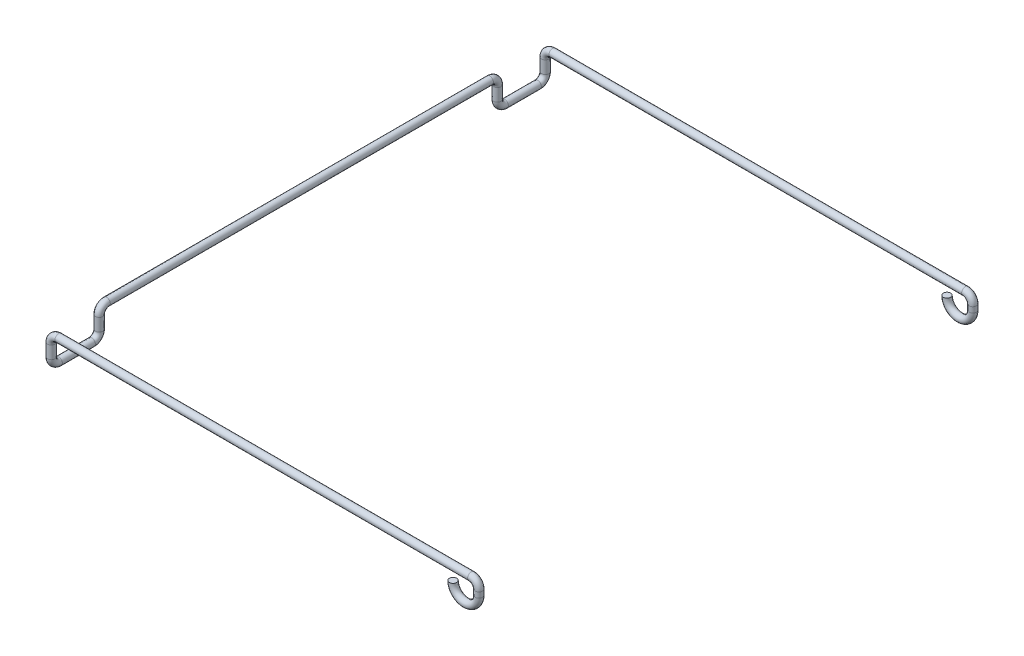
ISO-10303-21;
HEADER;
FILE_DESCRIPTION(('STEP AP214'),'2;1');
FILE_NAME('part.step','',(''),(''),'','','');
FILE_SCHEMA(('AUTOMOTIVE_DESIGN { 1 0 10303 214 1 1 1 1 }'));
ENDSEC;
DATA;
#1=APPLICATION_CONTEXT('core data for automotive mechanical design processes');
#2=APPLICATION_PROTOCOL_DEFINITION('international standard','automotive_design',2000,#1);
#3=PRODUCT_CONTEXT('',#1,'mechanical');
#4=PRODUCT('Part','Part','',(#3));
#5=PRODUCT_RELATED_PRODUCT_CATEGORY('part','',(#4));
#6=PRODUCT_DEFINITION_FORMATION('','',#4);
#7=PRODUCT_DEFINITION_CONTEXT('part definition',#1,'design');
#8=PRODUCT_DEFINITION('design','',#6,#7);
#9=PRODUCT_DEFINITION_SHAPE('','',#8);
#10=(LENGTH_UNIT() NAMED_UNIT(*) SI_UNIT(.MILLI.,.METRE.));
#11=(NAMED_UNIT(*) PLANE_ANGLE_UNIT() SI_UNIT($,.RADIAN.));
#12=(NAMED_UNIT(*) SI_UNIT($,.STERADIAN.) SOLID_ANGLE_UNIT());
#13=UNCERTAINTY_MEASURE_WITH_UNIT(LENGTH_MEASURE(1.E-05),#10,'distance_accuracy_value','');
#14=(GEOMETRIC_REPRESENTATION_CONTEXT(3) GLOBAL_UNCERTAINTY_ASSIGNED_CONTEXT((#13)) GLOBAL_UNIT_ASSIGNED_CONTEXT((#10,
#11,#12)) REPRESENTATION_CONTEXT('',''));
#15=CARTESIAN_POINT('',(0.,0.,0.));
#16=DIRECTION('',(0.,0.,1.));
#17=DIRECTION('',(1.,0.,0.));
#18=AXIS2_PLACEMENT_3D('',#15,#16,#17);
#19=CARTESIAN_POINT('',(45.9214738534762,-1.75000000000003,33.5));
#20=DIRECTION('',(0.,1.,0.));
#21=DIRECTION('',(1.,0.,0.));
#22=AXIS2_PLACEMENT_3D('',#19,#20,#21);
#23=PLANE('',#22);
#24=CARTESIAN_POINT('',(45.9214738534762,-1.75000000000003,33.5));
#25=DIRECTION('',(0.,1.,0.));
#26=DIRECTION('',(1.,0.,0.));
#27=AXIS2_PLACEMENT_3D('',#24,#25,#26);
#28=CIRCLE('',#27,0.500000000000001);
#29=CARTESIAN_POINT('',(45.4214738534762,-1.75000000000003,33.5));
#30=VERTEX_POINT('',#29);
#31=EDGE_CURVE('E110',#30,#30,#28,.T.);
#32=ORIENTED_EDGE('',*,*,#31,.T.);
#33=EDGE_LOOP('',(#32));
#34=FACE_BOUND('',#33,.T.);
#35=ADVANCED_FACE('F34',(#34),#23,.T.);
#36=CARTESIAN_POINT('',(45.9214763306861,-1.75294452515231,-33.5));
#37=DIRECTION('',(0.00168258580132002,-0.999998584451509,0.));
#38=DIRECTION('',(0.999998584451509,0.00168258580132002,0.));
#39=AXIS2_PLACEMENT_3D('',#36,#37,#38);
#40=PLANE('',#39);
#41=CARTESIAN_POINT('',(45.9214763306861,-1.75294452515231,-33.5));
#42=DIRECTION('',(0.00168258580132002,-0.999998584451509,0.));
#43=DIRECTION('',(0.999998584451509,0.00168258580132002,0.));
#44=AXIS2_PLACEMENT_3D('',#41,#42,#43);
#45=CIRCLE('',#44,0.500000000000001);
#46=CARTESIAN_POINT('',(45.4214770384604,-1.75378581805297,-33.5));
#47=VERTEX_POINT('',#46);
#48=EDGE_CURVE('E10',#47,#47,#45,.T.);
#49=ORIENTED_EDGE('',*,*,#48,.F.);
#50=EDGE_LOOP('',(#49));
#51=FACE_BOUND('',#50,.T.);
#52=ADVANCED_FACE('F118',(#51),#40,.F.);
#53=CARTESIAN_POINT('',(47.6714738534762,-1.75000000000003,33.5));
#54=DIRECTION('',(0.,0.,1.));
#55=DIRECTION('',(0.,-1.,0.));
#56=AXIS2_PLACEMENT_3D('',#53,#54,#55);
#57=TOROIDAL_SURFACE('',#56,1.75000000000004,0.500000000000001);
#58=CARTESIAN_POINT('',(49.4214738534763,-1.75000000000003,33.5));
#59=DIRECTION('',(0.,-1.,0.));
#60=DIRECTION('',(-1.,0.,0.));
#61=AXIS2_PLACEMENT_3D('',#58,#59,#60);
#62=CIRCLE('',#61,0.500000000000001);
#63=CARTESIAN_POINT('',(49.9214738534763,-1.75000000000003,33.5));
#64=VERTEX_POINT('',#63);
#65=EDGE_CURVE('E107',#64,#64,#62,.T.);
#66=CARTESIAN_POINT('',(47.6714738534762,-1.75000000000003,33.5));
#67=DIRECTION('',(0.,0.,1.));
#68=DIRECTION('',(0.,-1.,0.));
#69=AXIS2_PLACEMENT_3D('',#66,#67,#68);
#70=CIRCLE('',#69,2.25000000000004);
#71=EDGE_CURVE('',#30,#64,#70,.T.);
#72=ORIENTED_EDGE('',*,*,#31,.F.);
#73=ORIENTED_EDGE('',*,*,#65,.T.);
#74=ORIENTED_EDGE('',*,*,#71,.T.);
#75=ORIENTED_EDGE('',*,*,#71,.F.);
#76=EDGE_LOOP('',(#72,#74,#73,#75));
#77=FACE_BOUND('',#76,.T.);
#78=ADVANCED_FACE('F115',(#77),#57,.T.);
#79=CARTESIAN_POINT('',(49.4214738534763,-1.75000000000003,33.5));
#80=DIRECTION('',(0.,1.,0.));
#81=DIRECTION('',(0.,0.,1.));
#82=AXIS2_PLACEMENT_3D('',#79,#80,#81);
#83=CYLINDRICAL_SURFACE('',#82,0.500000000000001);
#84=CARTESIAN_POINT('',(49.4214738534763,-1.01303803451985,33.5));
#85=DIRECTION('',(0.,-1.,0.));
#86=DIRECTION('',(-1.,0.,0.));
#87=AXIS2_PLACEMENT_3D('',#84,#85,#86);
#88=CIRCLE('',#87,0.500000000000001);
#89=CARTESIAN_POINT('',(49.9214738534763,-1.01303803451985,33.5));
#90=VERTEX_POINT('',#89);
#91=EDGE_CURVE('E104',#90,#90,#88,.T.);
#92=ORIENTED_EDGE('',*,*,#91,.T.);
#93=EDGE_LOOP('',(#92));
#94=FACE_BOUND('',#93,.T.);
#95=ORIENTED_EDGE('',*,*,#65,.F.);
#96=EDGE_LOOP('',(#95));
#97=FACE_BOUND('',#96,.T.);
#98=ADVANCED_FACE('F117',(#94,#97),#83,.T.);
#99=CARTESIAN_POINT('',(48.4084358189564,-1.01303803451985,33.5));
#100=DIRECTION('',(0.,0.,1.));
#101=DIRECTION('',(1.,0.,0.));
#102=AXIS2_PLACEMENT_3D('',#99,#100,#101);
#103=TOROIDAL_SURFACE('',#102,1.01303803451987,0.500000000000001);
#104=CARTESIAN_POINT('',(48.4084358189564,0.,33.5));
#105=DIRECTION('',(1.,0.,0.));
#106=DIRECTION('',(0.,-1.,0.));
#107=AXIS2_PLACEMENT_3D('',#104,#105,#106);
#108=CIRCLE('',#107,0.500000000000001);
#109=CARTESIAN_POINT('',(48.4084358189564,0.500000000000017,33.5));
#110=VERTEX_POINT('',#109);
#111=EDGE_CURVE('E101',#110,#110,#108,.T.);
#112=CARTESIAN_POINT('',(48.4084358189564,-1.01303803451985,33.5));
#113=DIRECTION('',(0.,0.,1.));
#114=DIRECTION('',(1.,0.,0.));
#115=AXIS2_PLACEMENT_3D('',#112,#113,#114);
#116=CIRCLE('',#115,1.51303803451987);
#117=EDGE_CURVE('',#90,#110,#116,.T.);
#118=ORIENTED_EDGE('',*,*,#91,.F.);
#119=ORIENTED_EDGE('',*,*,#111,.T.);
#120=ORIENTED_EDGE('',*,*,#117,.T.);
#121=ORIENTED_EDGE('',*,*,#117,.F.);
#122=EDGE_LOOP('',(#118,#120,#119,#121));
#123=FACE_BOUND('',#122,.T.);
#124=ADVANCED_FACE('F125',(#123),#103,.T.);
#125=CARTESIAN_POINT('',(48.4084358189564,0.,33.5));
#126=DIRECTION('',(-1.,0.,0.));
#127=DIRECTION('',(0.,0.,1.));
#128=AXIS2_PLACEMENT_3D('',#125,#126,#127);
#129=CYLINDRICAL_SURFACE('',#128,0.500000000000001);
#130=CARTESIAN_POINT('',(-7.56548811200384,0.,33.5));
#131=DIRECTION('',(1.,0.,0.));
#132=DIRECTION('',(0.,-1.,0.));
#133=AXIS2_PLACEMENT_3D('',#130,#131,#132);
#134=CIRCLE('',#133,0.500000000000001);
#135=CARTESIAN_POINT('',(-7.56548811200384,0.500000000000015,33.5));
#136=VERTEX_POINT('',#135);
#137=EDGE_CURVE('E98',#136,#136,#134,.T.);
#138=ORIENTED_EDGE('',*,*,#137,.T.);
#139=EDGE_LOOP('',(#138));
#140=FACE_BOUND('',#139,.T.);
#141=ORIENTED_EDGE('',*,*,#111,.F.);
#142=EDGE_LOOP('',(#141));
#143=FACE_BOUND('',#142,.T.);
#144=ADVANCED_FACE('F206',(#140,#143),#129,.T.);
#145=CARTESIAN_POINT('',(-7.56548811200384,-1.01303803451985,33.5));
#146=DIRECTION('',(0.,0.,1.));
#147=DIRECTION('',(1.,0.,0.));
#148=AXIS2_PLACEMENT_3D('',#145,#146,#147);
#149=TOROIDAL_SURFACE('',#148,1.01303803451987,0.500000000000001);
#150=CARTESIAN_POINT('',(-8.57852614652371,-1.01303803451985,33.5));
#151=DIRECTION('',(0.,1.,0.));
#152=DIRECTION('',(1.,0.,0.));
#153=AXIS2_PLACEMENT_3D('',#150,#151,#152);
#154=CIRCLE('',#153,0.500000000000001);
#155=CARTESIAN_POINT('',(-9.07852614652371,-1.01303803451985,33.5));
#156=VERTEX_POINT('',#155);
#157=EDGE_CURVE('E95',#156,#156,#154,.T.);
#158=CARTESIAN_POINT('',(-7.56548811200384,-1.01303803451985,33.5));
#159=DIRECTION('',(0.,0.,1.));
#160=DIRECTION('',(1.,0.,0.));
#161=AXIS2_PLACEMENT_3D('',#158,#159,#160);
#162=CIRCLE('',#161,1.51303803451987);
#163=EDGE_CURVE('',#136,#156,#162,.T.);
#164=ORIENTED_EDGE('',*,*,#137,.F.);
#165=ORIENTED_EDGE('',*,*,#157,.T.);
#166=ORIENTED_EDGE('',*,*,#163,.T.);
#167=ORIENTED_EDGE('',*,*,#163,.F.);
#168=EDGE_LOOP('',(#164,#166,#165,#167));
#169=FACE_BOUND('',#168,.T.);
#170=ADVANCED_FACE('F202',(#169),#149,.T.);
#171=CARTESIAN_POINT('',(-8.57852614652371,-1.01303803451985,33.5));
#172=DIRECTION('',(0.,-1.,0.));
#173=DIRECTION('',(0.,0.,-1.));
#174=AXIS2_PLACEMENT_3D('',#171,#172,#173);
#175=CYLINDRICAL_SURFACE('',#174,0.500000000000001);
#176=CARTESIAN_POINT('',(-8.57852614652371,-2.73696196548015,33.5));
#177=DIRECTION('',(0.,1.,0.));
#178=DIRECTION('',(1.,0.,0.));
#179=AXIS2_PLACEMENT_3D('',#176,#177,#178);
#180=CIRCLE('',#179,0.500000000000001);
#181=CARTESIAN_POINT('',(-8.57852614652371,-2.73696196548015,34.));
#182=VERTEX_POINT('',#181);
#183=EDGE_CURVE('E92',#182,#182,#180,.T.);
#184=ORIENTED_EDGE('',*,*,#183,.T.);
#185=EDGE_LOOP('',(#184));
#186=FACE_BOUND('',#185,.T.);
#187=ORIENTED_EDGE('',*,*,#157,.F.);
#188=EDGE_LOOP('',(#187));
#189=FACE_BOUND('',#188,.T.);
#190=ADVANCED_FACE('F198',(#186,#189),#175,.T.);
#191=CARTESIAN_POINT('',(-8.57852614652371,-2.73696196548015,32.4869619654801));
#192=DIRECTION('',(1.,0.,0.));
#193=DIRECTION('',(0.,0.,-1.));
#194=AXIS2_PLACEMENT_3D('',#191,#192,#193);
#195=TOROIDAL_SURFACE('',#194,1.01303803451985,0.500000000000001);
#196=CARTESIAN_POINT('',(-8.57852614652371,-3.75,32.4869619654801));
#197=DIRECTION('',(0.,0.,1.));
#198=DIRECTION('',(1.,0.,0.));
#199=AXIS2_PLACEMENT_3D('',#196,#197,#198);
#200=CIRCLE('',#199,0.500000000000001);
#201=CARTESIAN_POINT('',(-8.57852614652371,-4.25,32.4869619654801));
#202=VERTEX_POINT('',#201);
#203=EDGE_CURVE('E89',#202,#202,#200,.T.);
#204=CARTESIAN_POINT('',(-8.57852614652371,-2.73696196548015,32.4869619654801));
#205=DIRECTION('',(1.,0.,0.));
#206=DIRECTION('',(0.,0.,-1.));
#207=AXIS2_PLACEMENT_3D('',#204,#205,#206);
#208=CIRCLE('',#207,1.51303803451985);
#209=EDGE_CURVE('',#182,#202,#208,.T.);
#210=ORIENTED_EDGE('',*,*,#183,.F.);
#211=ORIENTED_EDGE('',*,*,#203,.T.);
#212=ORIENTED_EDGE('',*,*,#209,.T.);
#213=ORIENTED_EDGE('',*,*,#209,.F.);
#214=EDGE_LOOP('',(#210,#212,#211,#213));
#215=FACE_BOUND('',#214,.T.);
#216=ADVANCED_FACE('F194',(#215),#195,.T.);
#217=CARTESIAN_POINT('',(-8.57852614652371,-3.75,32.4869619654801));
#218=DIRECTION('',(0.,0.,-1.));
#219=DIRECTION('',(-1.,0.,0.));
#220=AXIS2_PLACEMENT_3D('',#217,#218,#219);
#221=CYLINDRICAL_SURFACE('',#220,0.500000000000001);
#222=CARTESIAN_POINT('',(-8.57852614652371,-3.75,28.0130380345199));
#223=DIRECTION('',(0.,0.,1.));
#224=DIRECTION('',(1.,0.,0.));
#225=AXIS2_PLACEMENT_3D('',#222,#223,#224);
#226=CIRCLE('',#225,0.500000000000001);
#227=CARTESIAN_POINT('',(-8.57852614652371,-4.25,28.0130380345199));
#228=VERTEX_POINT('',#227);
#229=EDGE_CURVE('E86',#228,#228,#226,.T.);
#230=ORIENTED_EDGE('',*,*,#229,.T.);
#231=EDGE_LOOP('',(#230));
#232=FACE_BOUND('',#231,.T.);
#233=ORIENTED_EDGE('',*,*,#203,.F.);
#234=EDGE_LOOP('',(#233));
#235=FACE_BOUND('',#234,.T.);
#236=ADVANCED_FACE('F190',(#232,#235),#221,.T.);
#237=CARTESIAN_POINT('',(-8.57852614652371,-2.73696196548015,28.0130380345199));
#238=DIRECTION('',(1.,0.,0.));
#239=DIRECTION('',(0.,0.,-1.));
#240=AXIS2_PLACEMENT_3D('',#237,#238,#239);
#241=TOROIDAL_SURFACE('',#240,1.01303803451985,0.500000000000001);
#242=CARTESIAN_POINT('',(-8.57852614652371,-2.73696196548015,27.));
#243=DIRECTION('',(0.,-1.,0.));
#244=DIRECTION('',(1.,0.,0.));
#245=AXIS2_PLACEMENT_3D('',#242,#243,#244);
#246=CIRCLE('',#245,0.500000000000001);
#247=CARTESIAN_POINT('',(-8.57852614652371,-2.73696196548015,26.5));
#248=VERTEX_POINT('',#247);
#249=EDGE_CURVE('E83',#248,#248,#246,.T.);
#250=CARTESIAN_POINT('',(-8.57852614652371,-2.73696196548015,28.0130380345199));
#251=DIRECTION('',(1.,0.,0.));
#252=DIRECTION('',(0.,0.,-1.));
#253=AXIS2_PLACEMENT_3D('',#250,#251,#252);
#254=CIRCLE('',#253,1.51303803451985);
#255=EDGE_CURVE('',#228,#248,#254,.T.);
#256=ORIENTED_EDGE('',*,*,#229,.F.);
#257=ORIENTED_EDGE('',*,*,#249,.T.);
#258=ORIENTED_EDGE('',*,*,#255,.T.);
#259=ORIENTED_EDGE('',*,*,#255,.F.);
#260=EDGE_LOOP('',(#256,#258,#257,#259));
#261=FACE_BOUND('',#260,.T.);
#262=ADVANCED_FACE('F186',(#261),#241,.T.);
#263=CARTESIAN_POINT('',(-8.57852614652371,-2.73696196548015,27.));
#264=DIRECTION('',(0.,1.,0.));
#265=DIRECTION('',(0.,0.,1.));
#266=AXIS2_PLACEMENT_3D('',#263,#264,#265);
#267=CYLINDRICAL_SURFACE('',#266,0.500000000000001);
#268=CARTESIAN_POINT('',(-8.57852614652371,-1.01303803451985,27.));
#269=DIRECTION('',(0.,-1.,0.));
#270=DIRECTION('',(1.,0.,0.));
#271=AXIS2_PLACEMENT_3D('',#268,#269,#270);
#272=CIRCLE('',#271,0.500000000000001);
#273=CARTESIAN_POINT('',(-8.57852614652371,-1.01303803451985,27.5));
#274=VERTEX_POINT('',#273);
#275=EDGE_CURVE('E80',#274,#274,#272,.T.);
#276=ORIENTED_EDGE('',*,*,#275,.T.);
#277=EDGE_LOOP('',(#276));
#278=FACE_BOUND('',#277,.T.);
#279=ORIENTED_EDGE('',*,*,#249,.F.);
#280=EDGE_LOOP('',(#279));
#281=FACE_BOUND('',#280,.T.);
#282=ADVANCED_FACE('F182',(#278,#281),#267,.T.);
#283=CARTESIAN_POINT('',(-8.57852614652371,-1.01303803451985,25.9869619654802));
#284=DIRECTION('',(-1.,0.,0.));
#285=DIRECTION('',(0.,0.,1.));
#286=AXIS2_PLACEMENT_3D('',#283,#284,#285);
#287=TOROIDAL_SURFACE('',#286,1.01303803451985,0.500000000000001);
#288=CARTESIAN_POINT('',(-8.57852614652371,0.,25.9869619654802));
#289=DIRECTION('',(0.,0.,1.));
#290=DIRECTION('',(1.,0.,0.));
#291=AXIS2_PLACEMENT_3D('',#288,#289,#290);
#292=CIRCLE('',#291,0.500000000000001);
#293=CARTESIAN_POINT('',(-8.57852614652371,0.500000000000003,25.9869619654802));
#294=VERTEX_POINT('',#293);
#295=EDGE_CURVE('E77',#294,#294,#292,.T.);
#296=CARTESIAN_POINT('',(-8.57852614652371,-1.01303803451985,25.9869619654802));
#297=DIRECTION('',(-1.,0.,0.));
#298=DIRECTION('',(0.,0.,1.));
#299=AXIS2_PLACEMENT_3D('',#296,#297,#298);
#300=CIRCLE('',#299,1.51303803451985);
#301=EDGE_CURVE('',#274,#294,#300,.T.);
#302=ORIENTED_EDGE('',*,*,#275,.F.);
#303=ORIENTED_EDGE('',*,*,#295,.T.);
#304=ORIENTED_EDGE('',*,*,#301,.T.);
#305=ORIENTED_EDGE('',*,*,#301,.F.);
#306=EDGE_LOOP('',(#302,#304,#303,#305));
#307=FACE_BOUND('',#306,.T.);
#308=ADVANCED_FACE('F178',(#307),#287,.T.);
#309=CARTESIAN_POINT('',(-8.57852614652371,0.,25.9869619654802));
#310=DIRECTION('',(0.,0.,-1.));
#311=DIRECTION('',(0.,1.,0.));
#312=AXIS2_PLACEMENT_3D('',#309,#310,#311);
#313=CYLINDRICAL_SURFACE('',#312,0.500000000000001);
#314=CARTESIAN_POINT('',(-8.57852614652371,0.,-25.9869619654802));
#315=DIRECTION('',(0.,0.,1.));
#316=DIRECTION('',(1.,0.,0.));
#317=AXIS2_PLACEMENT_3D('',#314,#315,#316);
#318=CIRCLE('',#317,0.500000000000001);
#319=CARTESIAN_POINT('',(-8.57852614652371,0.500000000000002,-25.9869619654802));
#320=VERTEX_POINT('',#319);
#321=EDGE_CURVE('E74',#320,#320,#318,.T.);
#322=ORIENTED_EDGE('',*,*,#321,.T.);
#323=EDGE_LOOP('',(#322));
#324=FACE_BOUND('',#323,.T.);
#325=ORIENTED_EDGE('',*,*,#295,.F.);
#326=EDGE_LOOP('',(#325));
#327=FACE_BOUND('',#326,.T.);
#328=ADVANCED_FACE('F174',(#324,#327),#313,.T.);
#329=CARTESIAN_POINT('',(-8.57852614652371,-1.01303803451985,-25.9869619654802));
#330=DIRECTION('',(-1.,0.,0.));
#331=DIRECTION('',(0.,0.,1.));
#332=AXIS2_PLACEMENT_3D('',#329,#330,#331);
#333=TOROIDAL_SURFACE('',#332,1.01303803451985,0.500000000000001);
#334=CARTESIAN_POINT('',(-8.57852614652371,-1.01303803451985,-27.));
#335=DIRECTION('',(0.,1.,0.));
#336=DIRECTION('',(1.,0.,0.));
#337=AXIS2_PLACEMENT_3D('',#334,#335,#336);
#338=CIRCLE('',#337,0.500000000000001);
#339=CARTESIAN_POINT('',(-8.57852614652371,-1.01303803451985,-27.5));
#340=VERTEX_POINT('',#339);
#341=EDGE_CURVE('E71',#340,#340,#338,.T.);
#342=CARTESIAN_POINT('',(-8.57852614652371,-1.01303803451985,-25.9869619654802));
#343=DIRECTION('',(-1.,0.,0.));
#344=DIRECTION('',(0.,0.,1.));
#345=AXIS2_PLACEMENT_3D('',#342,#343,#344);
#346=CIRCLE('',#345,1.51303803451985);
#347=EDGE_CURVE('',#320,#340,#346,.T.);
#348=ORIENTED_EDGE('',*,*,#321,.F.);
#349=ORIENTED_EDGE('',*,*,#341,.T.);
#350=ORIENTED_EDGE('',*,*,#347,.T.);
#351=ORIENTED_EDGE('',*,*,#347,.F.);
#352=EDGE_LOOP('',(#348,#350,#349,#351));
#353=FACE_BOUND('',#352,.T.);
#354=ADVANCED_FACE('F170',(#353),#333,.T.);
#355=CARTESIAN_POINT('',(-8.57852614652371,-1.01303803451985,-27.));
#356=DIRECTION('',(0.,-1.,0.));
#357=DIRECTION('',(0.,0.,-1.));
#358=AXIS2_PLACEMENT_3D('',#355,#356,#357);
#359=CYLINDRICAL_SURFACE('',#358,0.500000000000001);
#360=CARTESIAN_POINT('',(-8.57852614652371,-2.73696196548015,-27.));
#361=DIRECTION('',(0.,1.,0.));
#362=DIRECTION('',(1.,0.,0.));
#363=AXIS2_PLACEMENT_3D('',#360,#361,#362);
#364=CIRCLE('',#363,0.500000000000001);
#365=CARTESIAN_POINT('',(-8.57852614652371,-2.73696196548015,-26.5));
#366=VERTEX_POINT('',#365);
#367=EDGE_CURVE('E68',#366,#366,#364,.T.);
#368=ORIENTED_EDGE('',*,*,#367,.T.);
#369=EDGE_LOOP('',(#368));
#370=FACE_BOUND('',#369,.T.);
#371=ORIENTED_EDGE('',*,*,#341,.F.);
#372=EDGE_LOOP('',(#371));
#373=FACE_BOUND('',#372,.T.);
#374=ADVANCED_FACE('F166',(#370,#373),#359,.T.);
#375=CARTESIAN_POINT('',(-8.57852614652371,-2.73696196548015,-28.0130380345199));
#376=DIRECTION('',(1.,0.,0.));
#377=DIRECTION('',(0.,0.,-1.));
#378=AXIS2_PLACEMENT_3D('',#375,#376,#377);
#379=TOROIDAL_SURFACE('',#378,1.01303803451985,0.500000000000001);
#380=CARTESIAN_POINT('',(-8.57852614652371,-3.75,-28.0130380345199));
#381=DIRECTION('',(0.,0.,1.));
#382=DIRECTION('',(1.,0.,0.));
#383=AXIS2_PLACEMENT_3D('',#380,#381,#382);
#384=CIRCLE('',#383,0.500000000000001);
#385=CARTESIAN_POINT('',(-8.57852614652371,-4.25,-28.0130380345199));
#386=VERTEX_POINT('',#385);
#387=EDGE_CURVE('E65',#386,#386,#384,.T.);
#388=CARTESIAN_POINT('',(-8.57852614652371,-2.73696196548015,-28.0130380345199));
#389=DIRECTION('',(1.,0.,0.));
#390=DIRECTION('',(0.,0.,-1.));
#391=AXIS2_PLACEMENT_3D('',#388,#389,#390);
#392=CIRCLE('',#391,1.51303803451985);
#393=EDGE_CURVE('',#366,#386,#392,.T.);
#394=ORIENTED_EDGE('',*,*,#367,.F.);
#395=ORIENTED_EDGE('',*,*,#387,.T.);
#396=ORIENTED_EDGE('',*,*,#393,.T.);
#397=ORIENTED_EDGE('',*,*,#393,.F.);
#398=EDGE_LOOP('',(#394,#396,#395,#397));
#399=FACE_BOUND('',#398,.T.);
#400=ADVANCED_FACE('F162',(#399),#379,.T.);
#401=CARTESIAN_POINT('',(-8.57852614652371,-3.75,-28.0130380345199));
#402=DIRECTION('',(0.,0.,-1.));
#403=DIRECTION('',(-1.,0.,0.));
#404=AXIS2_PLACEMENT_3D('',#401,#402,#403);
#405=CYLINDRICAL_SURFACE('',#404,0.500000000000001);
#406=CARTESIAN_POINT('',(-8.57852614652371,-3.75,-32.4869619654801));
#407=DIRECTION('',(0.,0.,1.));
#408=DIRECTION('',(1.,0.,0.));
#409=AXIS2_PLACEMENT_3D('',#406,#407,#408);
#410=CIRCLE('',#409,0.500000000000001);
#411=CARTESIAN_POINT('',(-8.57852614652371,-4.25,-32.4869619654801));
#412=VERTEX_POINT('',#411);
#413=EDGE_CURVE('E62',#412,#412,#410,.T.);
#414=ORIENTED_EDGE('',*,*,#413,.T.);
#415=EDGE_LOOP('',(#414));
#416=FACE_BOUND('',#415,.T.);
#417=ORIENTED_EDGE('',*,*,#387,.F.);
#418=EDGE_LOOP('',(#417));
#419=FACE_BOUND('',#418,.T.);
#420=ADVANCED_FACE('F158',(#416,#419),#405,.T.);
#421=CARTESIAN_POINT('',(-8.57852614652371,-2.73696196548015,-32.4869619654801));
#422=DIRECTION('',(1.,0.,0.));
#423=DIRECTION('',(0.,0.,-1.));
#424=AXIS2_PLACEMENT_3D('',#421,#422,#423);
#425=TOROIDAL_SURFACE('',#424,1.01303803451985,0.500000000000001);
#426=CARTESIAN_POINT('',(-8.57852614652371,-2.73696196548015,-33.5));
#427=DIRECTION('',(0.,-1.,0.));
#428=DIRECTION('',(1.,0.,0.));
#429=AXIS2_PLACEMENT_3D('',#426,#427,#428);
#430=CIRCLE('',#429,0.500000000000001);
#431=CARTESIAN_POINT('',(-8.57852614652371,-2.73696196548015,-34.));
#432=VERTEX_POINT('',#431);
#433=EDGE_CURVE('E59',#432,#432,#430,.T.);
#434=CARTESIAN_POINT('',(-8.57852614652371,-2.73696196548015,-32.4869619654801));
#435=DIRECTION('',(1.,0.,0.));
#436=DIRECTION('',(0.,0.,-1.));
#437=AXIS2_PLACEMENT_3D('',#434,#435,#436);
#438=CIRCLE('',#437,1.51303803451985);
#439=EDGE_CURVE('',#412,#432,#438,.T.);
#440=ORIENTED_EDGE('',*,*,#413,.F.);
#441=ORIENTED_EDGE('',*,*,#433,.T.);
#442=ORIENTED_EDGE('',*,*,#439,.T.);
#443=ORIENTED_EDGE('',*,*,#439,.F.);
#444=EDGE_LOOP('',(#440,#442,#441,#443));
#445=FACE_BOUND('',#444,.T.);
#446=ADVANCED_FACE('F154',(#445),#425,.T.);
#447=CARTESIAN_POINT('',(-8.57852614652371,-2.73696196548015,-33.5));
#448=DIRECTION('',(0.,1.,0.));
#449=DIRECTION('',(0.,0.,1.));
#450=AXIS2_PLACEMENT_3D('',#447,#448,#449);
#451=CYLINDRICAL_SURFACE('',#450,0.500000000000001);
#452=CARTESIAN_POINT('',(-8.57852614652371,-1.01303803451985,-33.5));
#453=DIRECTION('',(0.,-1.,0.));
#454=DIRECTION('',(1.,0.,0.));
#455=AXIS2_PLACEMENT_3D('',#452,#453,#454);
#456=CIRCLE('',#455,0.500000000000001);
#457=CARTESIAN_POINT('',(-9.07852614652371,-1.01303803451985,-33.5));
#458=VERTEX_POINT('',#457);
#459=EDGE_CURVE('E56',#458,#458,#456,.T.);
#460=ORIENTED_EDGE('',*,*,#459,.T.);
#461=EDGE_LOOP('',(#460));
#462=FACE_BOUND('',#461,.T.);
#463=ORIENTED_EDGE('',*,*,#433,.F.);
#464=EDGE_LOOP('',(#463));
#465=FACE_BOUND('',#464,.T.);
#466=ADVANCED_FACE('F150',(#462,#465),#451,.T.);
#467=CARTESIAN_POINT('',(-7.56548811200384,-1.01303803451985,-33.5));
#468=DIRECTION('',(0.,0.,-1.));
#469=DIRECTION('',(-1.,0.,0.));
#470=AXIS2_PLACEMENT_3D('',#467,#468,#469);
#471=TOROIDAL_SURFACE('',#470,1.01303803451987,0.500000000000001);
#472=CARTESIAN_POINT('',(-7.56548811200384,0.,-33.5));
#473=DIRECTION('',(-1.,0.,0.));
#474=DIRECTION('',(0.,-1.,0.));
#475=AXIS2_PLACEMENT_3D('',#472,#473,#474);
#476=CIRCLE('',#475,0.500000000000001);
#477=CARTESIAN_POINT('',(-7.56548811200384,0.500000000000015,-33.5));
#478=VERTEX_POINT('',#477);
#479=EDGE_CURVE('E53',#478,#478,#476,.T.);
#480=CARTESIAN_POINT('',(-7.56548811200384,-1.01303803451985,-33.5));
#481=DIRECTION('',(0.,0.,-1.));
#482=DIRECTION('',(-1.,0.,0.));
#483=AXIS2_PLACEMENT_3D('',#480,#481,#482);
#484=CIRCLE('',#483,1.51303803451987);
#485=EDGE_CURVE('',#458,#478,#484,.T.);
#486=ORIENTED_EDGE('',*,*,#459,.F.);
#487=ORIENTED_EDGE('',*,*,#479,.T.);
#488=ORIENTED_EDGE('',*,*,#485,.T.);
#489=ORIENTED_EDGE('',*,*,#485,.F.);
#490=EDGE_LOOP('',(#486,#488,#487,#489));
#491=FACE_BOUND('',#490,.T.);
#492=ADVANCED_FACE('F146',(#491),#471,.T.);
#493=CARTESIAN_POINT('',(-7.56548811200384,0.,-33.5));
#494=DIRECTION('',(1.,0.,0.));
#495=DIRECTION('',(0.,0.,-1.));
#496=AXIS2_PLACEMENT_3D('',#493,#494,#495);
#497=CYLINDRICAL_SURFACE('',#496,0.500000000000001);
#498=CARTESIAN_POINT('',(48.4084358189564,0.,-33.5));
#499=DIRECTION('',(-1.,0.,0.));
#500=DIRECTION('',(0.,-1.,0.));
#501=AXIS2_PLACEMENT_3D('',#498,#499,#500);
#502=CIRCLE('',#501,0.500000000000001);
#503=CARTESIAN_POINT('',(48.4084358189564,0.500000000000015,-33.5));
#504=VERTEX_POINT('',#503);
#505=EDGE_CURVE('E48',#504,#504,#502,.T.);
#506=ORIENTED_EDGE('',*,*,#505,.T.);
#507=EDGE_LOOP('',(#506));
#508=FACE_BOUND('',#507,.T.);
#509=ORIENTED_EDGE('',*,*,#479,.F.);
#510=EDGE_LOOP('',(#509));
#511=FACE_BOUND('',#510,.T.);
#512=ADVANCED_FACE('F142',(#508,#511),#497,.T.);
#513=CARTESIAN_POINT('',(48.4084358189564,-1.01303803451985,-33.5));
#514=DIRECTION('',(0.,0.,-1.));
#515=DIRECTION('',(-1.,0.,0.));
#516=AXIS2_PLACEMENT_3D('',#513,#514,#515);
#517=TOROIDAL_SURFACE('',#516,1.01303803451987,0.500000000000001);
#518=CARTESIAN_POINT('',(49.4214738534763,-1.01303803451985,-33.5));
#519=DIRECTION('',(0.,1.,0.));
#520=DIRECTION('',(-1.,0.,0.));
#521=AXIS2_PLACEMENT_3D('',#518,#519,#520);
#522=CIRCLE('',#521,0.500000000000001);
#523=CARTESIAN_POINT('',(49.9214738534763,-1.01303803451985,-33.5));
#524=VERTEX_POINT('',#523);
#525=EDGE_CURVE('E44',#524,#524,#522,.T.);
#526=CARTESIAN_POINT('',(48.4084358189564,-1.01303803451985,-33.5));
#527=DIRECTION('',(0.,0.,-1.));
#528=DIRECTION('',(-1.,0.,0.));
#529=AXIS2_PLACEMENT_3D('',#526,#527,#528);
#530=CIRCLE('',#529,1.51303803451987);
#531=EDGE_CURVE('',#504,#524,#530,.T.);
#532=ORIENTED_EDGE('',*,*,#505,.F.);
#533=ORIENTED_EDGE('',*,*,#525,.T.);
#534=ORIENTED_EDGE('',*,*,#531,.T.);
#535=ORIENTED_EDGE('',*,*,#531,.F.);
#536=EDGE_LOOP('',(#532,#534,#533,#535));
#537=FACE_BOUND('',#536,.T.);
#538=ADVANCED_FACE('F136',(#537),#517,.T.);
#539=CARTESIAN_POINT('',(49.4214738534763,-1.01303803451985,-33.5));
#540=DIRECTION('',(0.,-1.,0.));
#541=DIRECTION('',(0.,0.,-1.));
#542=AXIS2_PLACEMENT_3D('',#539,#540,#541);
#543=CYLINDRICAL_SURFACE('',#542,0.500000000000001);
#544=CARTESIAN_POINT('',(49.4214738534763,-1.75,-33.5));
#545=DIRECTION('',(0.,1.,0.));
#546=DIRECTION('',(-1.,0.,0.));
#547=AXIS2_PLACEMENT_3D('',#544,#545,#546);
#548=CIRCLE('',#547,0.500000000000001);
#549=CARTESIAN_POINT('',(49.9214738534763,-1.75,-33.5));
#550=VERTEX_POINT('',#549);
#551=EDGE_CURVE('E40',#550,#550,#548,.T.);
#552=ORIENTED_EDGE('',*,*,#551,.T.);
#553=EDGE_LOOP('',(#552));
#554=FACE_BOUND('',#553,.T.);
#555=ORIENTED_EDGE('',*,*,#525,.F.);
#556=EDGE_LOOP('',(#555));
#557=FACE_BOUND('',#556,.T.);
#558=ADVANCED_FACE('F131',(#554,#557),#543,.T.);
#559=CARTESIAN_POINT('',(47.6714738534763,-1.75,-33.5));
#560=DIRECTION('',(0.,0.,-1.));
#561=DIRECTION('',(-1.,0.,0.));
#562=AXIS2_PLACEMENT_3D('',#559,#560,#561);
#563=TOROIDAL_SURFACE('',#562,1.75000000000002,0.500000000000001);
#564=CARTESIAN_POINT('',(47.6714738534763,-1.75,-33.5));
#565=DIRECTION('',(0.,0.,-1.));
#566=DIRECTION('',(-1.,0.,0.));
#567=AXIS2_PLACEMENT_3D('',#564,#565,#566);
#568=CIRCLE('',#567,2.25000000000002);
#569=EDGE_CURVE('',#550,#47,#568,.T.);
#570=ORIENTED_EDGE('',*,*,#551,.F.);
#571=ORIENTED_EDGE('',*,*,#48,.T.);
#572=ORIENTED_EDGE('',*,*,#569,.T.);
#573=ORIENTED_EDGE('',*,*,#569,.F.);
#574=EDGE_LOOP('',(#570,#572,#571,#573));
#575=FACE_BOUND('',#574,.T.);
#576=ADVANCED_FACE('F129',(#575),#563,.T.);
#577=CLOSED_SHELL('',(#35,#52,#78,#98,#124,#144,#170,#190,#216,#236,#262,#282,#308,#328,#354,
#374,#400,#420,#446,#466,#492,#512,#538,#558,#576));
#578=MANIFOLD_SOLID_BREP('B2',#577);
#579=ADVANCED_BREP_SHAPE_REPRESENTATION('',(#18,#578),#14);
#580=SHAPE_DEFINITION_REPRESENTATION(#9,#579);
ENDSEC;
END-ISO-10303-21;
